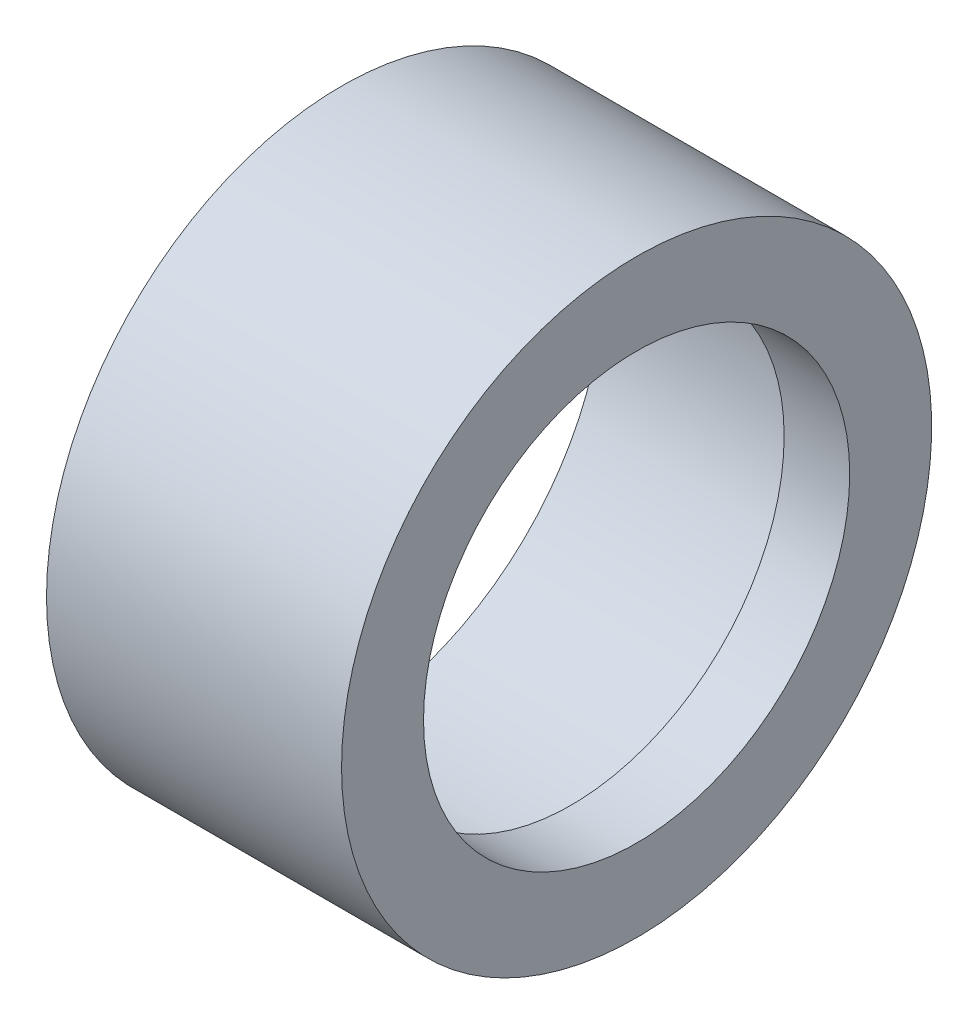
ISO-10303-21;
HEADER;
FILE_DESCRIPTION(('STEP AP214'),'2;1');
FILE_NAME('part.step','',(''),(''),'','','');
FILE_SCHEMA(('AUTOMOTIVE_DESIGN { 1 0 10303 214 1 1 1 1 }'));
ENDSEC;
DATA;
#1=APPLICATION_CONTEXT('core data for automotive mechanical design processes');
#2=APPLICATION_PROTOCOL_DEFINITION('international standard','automotive_design',2000,#1);
#3=PRODUCT_CONTEXT('',#1,'mechanical');
#4=PRODUCT('Part','Part','',(#3));
#5=PRODUCT_RELATED_PRODUCT_CATEGORY('part','',(#4));
#6=PRODUCT_DEFINITION_FORMATION('','',#4);
#7=PRODUCT_DEFINITION_CONTEXT('part definition',#1,'design');
#8=PRODUCT_DEFINITION('design','',#6,#7);
#9=PRODUCT_DEFINITION_SHAPE('','',#8);
#10=(LENGTH_UNIT() NAMED_UNIT(*) SI_UNIT(.MILLI.,.METRE.));
#11=(NAMED_UNIT(*) PLANE_ANGLE_UNIT() SI_UNIT($,.RADIAN.));
#12=(NAMED_UNIT(*) SI_UNIT($,.STERADIAN.) SOLID_ANGLE_UNIT());
#13=UNCERTAINTY_MEASURE_WITH_UNIT(LENGTH_MEASURE(1.E-05),#10,'distance_accuracy_value','');
#14=(GEOMETRIC_REPRESENTATION_CONTEXT(3) GLOBAL_UNCERTAINTY_ASSIGNED_CONTEXT((#13)) GLOBAL_UNIT_ASSIGNED_CONTEXT((#10,
#11,#12)) REPRESENTATION_CONTEXT('',''));
#15=CARTESIAN_POINT('',(0.,0.,0.));
#16=DIRECTION('',(0.,0.,1.));
#17=DIRECTION('',(1.,0.,0.));
#18=AXIS2_PLACEMENT_3D('',#15,#16,#17);
#19=CARTESIAN_POINT('',(0.,4.5,0.));
#20=DIRECTION('',(1.,0.,0.));
#21=DIRECTION('',(0.,0.,-1.));
#22=AXIS2_PLACEMENT_3D('',#19,#20,#21);
#23=PLANE('',#22);
#24=CARTESIAN_POINT('',(0.,0.,0.));
#25=DIRECTION('',(-1.,0.,0.));
#26=DIRECTION('',(0.,0.,1.));
#27=AXIS2_PLACEMENT_3D('',#24,#25,#26);
#28=CIRCLE('',#27,4.);
#29=CARTESIAN_POINT('',(0.,0.,4.));
#30=VERTEX_POINT('',#29);
#31=EDGE_CURVE('E10',#30,#30,#28,.T.);
#32=ORIENTED_EDGE('',*,*,#31,.F.);
#33=EDGE_LOOP('',(#32));
#34=FACE_BOUND('',#33,.T.);
#35=CARTESIAN_POINT('',(0.,0.,0.));
#36=DIRECTION('',(-1.,0.,0.));
#37=DIRECTION('',(0.,0.,1.));
#38=AXIS2_PLACEMENT_3D('',#35,#36,#37);
#39=CIRCLE('',#38,4.5);
#40=CARTESIAN_POINT('',(0.,0.,4.5));
#41=VERTEX_POINT('',#40);
#42=EDGE_CURVE('E51',#41,#41,#39,.T.);
#43=ORIENTED_EDGE('',*,*,#42,.T.);
#44=EDGE_LOOP('',(#43));
#45=FACE_BOUND('',#44,.T.);
#46=ADVANCED_FACE('F29',(#34,#45),#23,.F.);
#47=CARTESIAN_POINT('',(0.,0.,0.));
#48=DIRECTION('',(-1.,0.,0.));
#49=DIRECTION('',(0.,0.,1.));
#50=AXIS2_PLACEMENT_3D('',#47,#48,#49);
#51=CYLINDRICAL_SURFACE('',#50,4.);
#52=CARTESIAN_POINT('',(3.5,0.,0.));
#53=DIRECTION('',(-1.,0.,0.));
#54=DIRECTION('',(0.,0.,1.));
#55=AXIS2_PLACEMENT_3D('',#52,#53,#54);
#56=CIRCLE('',#55,4.);
#57=CARTESIAN_POINT('',(3.5,0.,4.));
#58=VERTEX_POINT('',#57);
#59=EDGE_CURVE('E35',#58,#58,#56,.T.);
#60=ORIENTED_EDGE('',*,*,#59,.F.);
#61=EDGE_LOOP('',(#60));
#62=FACE_BOUND('',#61,.T.);
#63=ORIENTED_EDGE('',*,*,#31,.T.);
#64=EDGE_LOOP('',(#63));
#65=FACE_BOUND('',#64,.T.);
#66=ADVANCED_FACE('F76',(#62,#65),#51,.F.);
#67=CARTESIAN_POINT('',(3.5,4.,0.));
#68=DIRECTION('',(1.,0.,0.));
#69=DIRECTION('',(0.,0.,-1.));
#70=AXIS2_PLACEMENT_3D('',#67,#68,#69);
#71=PLANE('',#70);
#72=CARTESIAN_POINT('',(3.5,0.,0.));
#73=DIRECTION('',(-1.,0.,0.));
#74=DIRECTION('',(0.,0.,1.));
#75=AXIS2_PLACEMENT_3D('',#72,#73,#74);
#76=CIRCLE('',#75,3.25);
#77=CARTESIAN_POINT('',(3.5,0.,3.25));
#78=VERTEX_POINT('',#77);
#79=EDGE_CURVE('E39',#78,#78,#76,.T.);
#80=ORIENTED_EDGE('',*,*,#79,.F.);
#81=EDGE_LOOP('',(#80));
#82=FACE_BOUND('',#81,.T.);
#83=ORIENTED_EDGE('',*,*,#59,.T.);
#84=EDGE_LOOP('',(#83));
#85=FACE_BOUND('',#84,.T.);
#86=ADVANCED_FACE('F71',(#82,#85),#71,.F.);
#87=CARTESIAN_POINT('',(0.,0.,0.));
#88=DIRECTION('',(-1.,0.,0.));
#89=DIRECTION('',(0.,0.,1.));
#90=AXIS2_PLACEMENT_3D('',#87,#88,#89);
#91=CYLINDRICAL_SURFACE('',#90,3.25);
#92=CARTESIAN_POINT('',(4.5,0.,0.));
#93=DIRECTION('',(-1.,0.,0.));
#94=DIRECTION('',(0.,0.,1.));
#95=AXIS2_PLACEMENT_3D('',#92,#93,#94);
#96=CIRCLE('',#95,3.25);
#97=CARTESIAN_POINT('',(4.5,0.,3.25));
#98=VERTEX_POINT('',#97);
#99=EDGE_CURVE('E43',#98,#98,#96,.T.);
#100=ORIENTED_EDGE('',*,*,#99,.F.);
#101=EDGE_LOOP('',(#100));
#102=FACE_BOUND('',#101,.T.);
#103=ORIENTED_EDGE('',*,*,#79,.T.);
#104=EDGE_LOOP('',(#103));
#105=FACE_BOUND('',#104,.T.);
#106=ADVANCED_FACE('F65',(#102,#105),#91,.F.);
#107=CARTESIAN_POINT('',(4.5,3.25,0.));
#108=DIRECTION('',(-1.,0.,0.));
#109=DIRECTION('',(0.,0.,1.));
#110=AXIS2_PLACEMENT_3D('',#107,#108,#109);
#111=PLANE('',#110);
#112=CARTESIAN_POINT('',(4.5,0.,0.));
#113=DIRECTION('',(-1.,0.,0.));
#114=DIRECTION('',(0.,0.,1.));
#115=AXIS2_PLACEMENT_3D('',#112,#113,#114);
#116=CIRCLE('',#115,4.5);
#117=CARTESIAN_POINT('',(4.5,0.,4.5));
#118=VERTEX_POINT('',#117);
#119=EDGE_CURVE('E48',#118,#118,#116,.T.);
#120=ORIENTED_EDGE('',*,*,#119,.F.);
#121=EDGE_LOOP('',(#120));
#122=FACE_BOUND('',#121,.T.);
#123=ORIENTED_EDGE('',*,*,#99,.T.);
#124=EDGE_LOOP('',(#123));
#125=FACE_BOUND('',#124,.T.);
#126=ADVANCED_FACE('F59',(#122,#125),#111,.F.);
#127=CARTESIAN_POINT('',(0.,0.,0.));
#128=DIRECTION('',(-1.,0.,0.));
#129=DIRECTION('',(0.,0.,1.));
#130=AXIS2_PLACEMENT_3D('',#127,#128,#129);
#131=CYLINDRICAL_SURFACE('',#130,4.5);
#132=ORIENTED_EDGE('',*,*,#42,.F.);
#133=EDGE_LOOP('',(#132));
#134=FACE_BOUND('',#133,.T.);
#135=ORIENTED_EDGE('',*,*,#119,.T.);
#136=EDGE_LOOP('',(#135));
#137=FACE_BOUND('',#136,.T.);
#138=ADVANCED_FACE('F56',(#134,#137),#131,.T.);
#139=CLOSED_SHELL('',(#46,#66,#86,#106,#126,#138));
#140=MANIFOLD_SOLID_BREP('B2',#139);
#141=ADVANCED_BREP_SHAPE_REPRESENTATION('',(#18,#140),#14);
#142=SHAPE_DEFINITION_REPRESENTATION(#9,#141);
ENDSEC;
END-ISO-10303-21;
